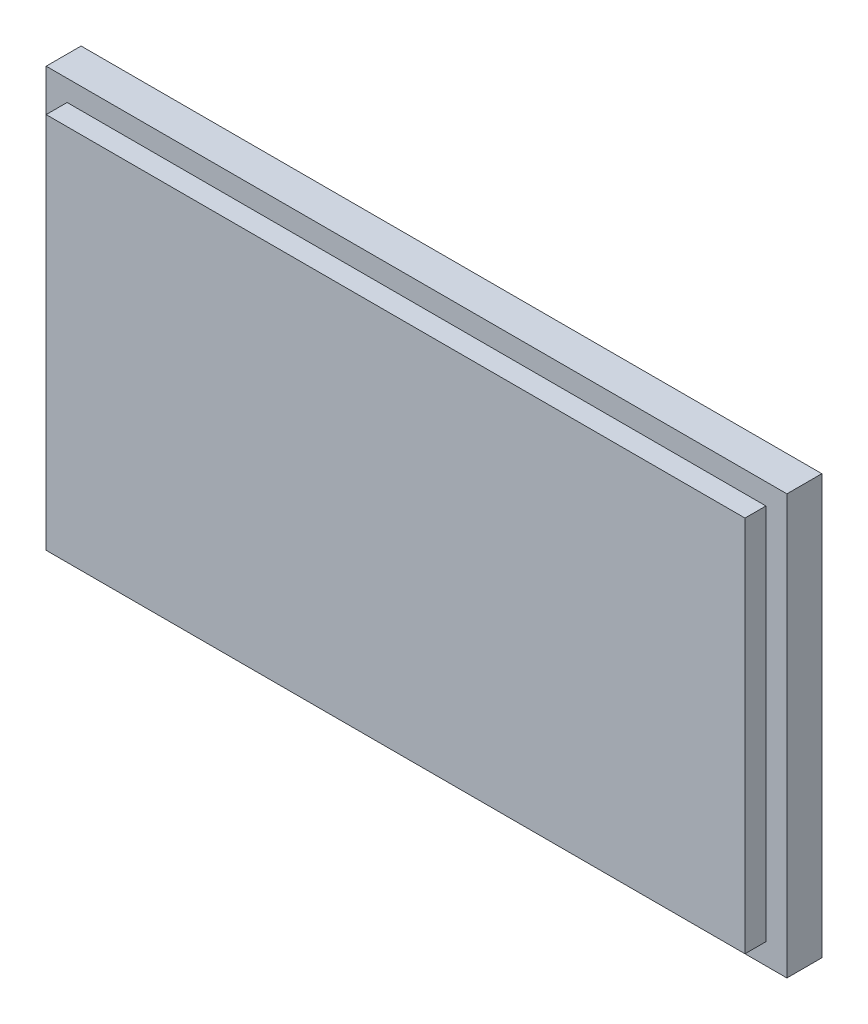
ISO-10303-21;
HEADER;
FILE_DESCRIPTION(('STEP AP214'),'2;1');
FILE_NAME('part.step','',(''),(''),'','','');
FILE_SCHEMA(('AUTOMOTIVE_DESIGN { 1 0 10303 214 1 1 1 1 }'));
ENDSEC;
DATA;
#1=APPLICATION_CONTEXT('core data for automotive mechanical design processes');
#2=APPLICATION_PROTOCOL_DEFINITION('international standard','automotive_design',2000,#1);
#3=PRODUCT_CONTEXT('',#1,'mechanical');
#4=PRODUCT('Part','Part','',(#3));
#5=PRODUCT_RELATED_PRODUCT_CATEGORY('part','',(#4));
#6=PRODUCT_DEFINITION_FORMATION('','',#4);
#7=PRODUCT_DEFINITION_CONTEXT('part definition',#1,'design');
#8=PRODUCT_DEFINITION('design','',#6,#7);
#9=PRODUCT_DEFINITION_SHAPE('','',#8);
#10=(LENGTH_UNIT() NAMED_UNIT(*) SI_UNIT(.MILLI.,.METRE.));
#11=(NAMED_UNIT(*) PLANE_ANGLE_UNIT() SI_UNIT($,.RADIAN.));
#12=(NAMED_UNIT(*) SI_UNIT($,.STERADIAN.) SOLID_ANGLE_UNIT());
#13=UNCERTAINTY_MEASURE_WITH_UNIT(LENGTH_MEASURE(1.E-05),#10,'distance_accuracy_value','');
#14=(GEOMETRIC_REPRESENTATION_CONTEXT(3) GLOBAL_UNCERTAINTY_ASSIGNED_CONTEXT((#13)) GLOBAL_UNIT_ASSIGNED_CONTEXT((#10,
#11,#12)) REPRESENTATION_CONTEXT('',''));
#15=CARTESIAN_POINT('',(0.,0.,0.));
#16=DIRECTION('',(0.,0.,1.));
#17=DIRECTION('',(1.,0.,0.));
#18=AXIS2_PLACEMENT_3D('',#15,#16,#17);
#19=CARTESIAN_POINT('',(26.5,15.,4.));
#20=DIRECTION('',(-1.,0.,0.));
#21=DIRECTION('',(0.,0.,1.));
#22=AXIS2_PLACEMENT_3D('',#19,#20,#21);
#23=PLANE('',#22);
#24=DIRECTION('',(0.,1.,0.));
#25=VECTOR('',#24,1.);
#26=CARTESIAN_POINT('',(26.5,15.,2.5));
#27=LINE('',#26,#25);
#28=CARTESIAN_POINT('',(26.5,-15.,2.5));
#29=VERTEX_POINT('',#28);
#30=CARTESIAN_POINT('',(26.5,15.,2.5));
#31=VERTEX_POINT('',#30);
#32=EDGE_CURVE('E161',#29,#31,#27,.T.);
#33=ORIENTED_EDGE('',*,*,#32,.F.);
#34=DIRECTION('',(0.,0.,-1.));
#35=VECTOR('',#34,1.);
#36=CARTESIAN_POINT('',(26.5,-15.,4.));
#37=LINE('',#36,#35);
#38=CARTESIAN_POINT('',(26.5,-15.,0.));
#39=VERTEX_POINT('',#38);
#40=EDGE_CURVE('E180',#29,#39,#37,.T.);
#41=ORIENTED_EDGE('',*,*,#40,.T.);
#42=DIRECTION('',(0.,1.,0.));
#43=VECTOR('',#42,1.);
#44=CARTESIAN_POINT('',(26.5,15.,0.));
#45=LINE('',#44,#43);
#46=CARTESIAN_POINT('',(26.5,15.,0.));
#47=VERTEX_POINT('',#46);
#48=EDGE_CURVE('E164',#39,#47,#45,.T.);
#49=ORIENTED_EDGE('',*,*,#48,.T.);
#50=DIRECTION('',(0.,0.,-1.));
#51=VECTOR('',#50,1.);
#52=CARTESIAN_POINT('',(26.5,15.,4.));
#53=LINE('',#52,#51);
#54=EDGE_CURVE('E48',#31,#47,#53,.T.);
#55=ORIENTED_EDGE('',*,*,#54,.F.);
#56=EDGE_LOOP('',(#33,#41,#49,#55));
#57=FACE_BOUND('',#56,.T.);
#58=ADVANCED_FACE('F40',(#57),#23,.F.);
#59=CARTESIAN_POINT('',(-26.5,15.,4.));
#60=DIRECTION('',(0.,-1.,0.));
#61=DIRECTION('',(0.,0.,-1.));
#62=AXIS2_PLACEMENT_3D('',#59,#60,#61);
#63=PLANE('',#62);
#64=DIRECTION('',(-1.,0.,0.));
#65=VECTOR('',#64,1.);
#66=CARTESIAN_POINT('',(-26.5,15.,2.5));
#67=LINE('',#66,#65);
#68=CARTESIAN_POINT('',(-26.5,15.,2.5));
#69=VERTEX_POINT('',#68);
#70=EDGE_CURVE('E158',#31,#69,#67,.T.);
#71=ORIENTED_EDGE('',*,*,#70,.F.);
#72=ORIENTED_EDGE('',*,*,#54,.T.);
#73=DIRECTION('',(-1.,0.,0.));
#74=VECTOR('',#73,1.);
#75=CARTESIAN_POINT('',(-26.5,15.,0.));
#76=LINE('',#75,#74);
#77=CARTESIAN_POINT('',(-26.5,15.,0.));
#78=VERTEX_POINT('',#77);
#79=EDGE_CURVE('E168',#47,#78,#76,.T.);
#80=ORIENTED_EDGE('',*,*,#79,.T.);
#81=DIRECTION('',(0.,0.,-1.));
#82=VECTOR('',#81,1.);
#83=CARTESIAN_POINT('',(-26.5,15.,4.));
#84=LINE('',#83,#82);
#85=EDGE_CURVE('E186',#69,#78,#84,.T.);
#86=ORIENTED_EDGE('',*,*,#85,.F.);
#87=EDGE_LOOP('',(#71,#72,#80,#86));
#88=FACE_BOUND('',#87,.T.);
#89=ADVANCED_FACE('F193',(#88),#63,.F.);
#90=CARTESIAN_POINT('',(-26.5,15.,4.));
#91=DIRECTION('',(1.,0.,0.));
#92=DIRECTION('',(0.,1.,0.));
#93=AXIS2_PLACEMENT_3D('',#90,#91,#92);
#94=PLANE('',#93);
#95=DIRECTION('',(0.,-1.,0.));
#96=VECTOR('',#95,1.);
#97=CARTESIAN_POINT('',(-26.5,15.,2.5));
#98=LINE('',#97,#96);
#99=CARTESIAN_POINT('',(-26.5,-15.,2.5));
#100=VERTEX_POINT('',#99);
#101=EDGE_CURVE('E54',#69,#100,#98,.T.);
#102=ORIENTED_EDGE('',*,*,#101,.F.);
#103=ORIENTED_EDGE('',*,*,#85,.T.);
#104=DIRECTION('',(0.,-1.,0.));
#105=VECTOR('',#104,1.);
#106=CARTESIAN_POINT('',(-26.5,15.,0.));
#107=LINE('',#106,#105);
#108=CARTESIAN_POINT('',(-26.5,-15.,0.));
#109=VERTEX_POINT('',#108);
#110=EDGE_CURVE('E172',#78,#109,#107,.T.);
#111=ORIENTED_EDGE('',*,*,#110,.T.);
#112=DIRECTION('',(0.,0.,-1.));
#113=VECTOR('',#112,1.);
#114=CARTESIAN_POINT('',(-26.5,-15.,4.));
#115=LINE('',#114,#113);
#116=EDGE_CURVE('E183',#100,#109,#115,.T.);
#117=ORIENTED_EDGE('',*,*,#116,.F.);
#118=EDGE_LOOP('',(#102,#103,#111,#117));
#119=FACE_BOUND('',#118,.T.);
#120=ADVANCED_FACE('F207',(#119),#94,.F.);
#121=CARTESIAN_POINT('',(-26.5,-15.,4.));
#122=DIRECTION('',(0.,1.,0.));
#123=DIRECTION('',(0.,0.,1.));
#124=AXIS2_PLACEMENT_3D('',#121,#122,#123);
#125=PLANE('',#124);
#126=DIRECTION('',(1.,0.,0.));
#127=VECTOR('',#126,1.);
#128=CARTESIAN_POINT('',(-26.5,-15.,2.5));
#129=LINE('',#128,#127);
#130=EDGE_CURVE('E12',#100,#29,#129,.T.);
#131=ORIENTED_EDGE('',*,*,#130,.F.);
#132=ORIENTED_EDGE('',*,*,#116,.T.);
#133=DIRECTION('',(1.,0.,0.));
#134=VECTOR('',#133,1.);
#135=CARTESIAN_POINT('',(-26.5,-15.,0.));
#136=LINE('',#135,#134);
#137=EDGE_CURVE('E176',#109,#39,#136,.T.);
#138=ORIENTED_EDGE('',*,*,#137,.T.);
#139=ORIENTED_EDGE('',*,*,#40,.F.);
#140=EDGE_LOOP('',(#131,#132,#138,#139));
#141=FACE_BOUND('',#140,.T.);
#142=ADVANCED_FACE('F204',(#141),#125,.F.);
#143=CARTESIAN_POINT('',(0.,0.,0.));
#144=DIRECTION('',(0.,0.,1.));
#145=DIRECTION('',(1.,0.,0.));
#146=AXIS2_PLACEMENT_3D('',#143,#144,#145);
#147=PLANE('',#146);
#148=ORIENTED_EDGE('',*,*,#48,.F.);
#149=ORIENTED_EDGE('',*,*,#137,.F.);
#150=ORIENTED_EDGE('',*,*,#110,.F.);
#151=ORIENTED_EDGE('',*,*,#79,.F.);
#152=EDGE_LOOP('',(#148,#149,#150,#151));
#153=FACE_BOUND('',#152,.T.);
#154=ADVANCED_FACE('F200',(#153),#147,.F.);
#155=CARTESIAN_POINT('',(0.,0.,2.5));
#156=DIRECTION('',(0.,0.,1.));
#157=DIRECTION('',(1.,0.,0.));
#158=AXIS2_PLACEMENT_3D('',#155,#156,#157);
#159=PLANE('',#158);
#160=DIRECTION('',(1.,0.,0.));
#161=VECTOR('',#160,1.);
#162=CARTESIAN_POINT('',(-25.,-13.5,2.5));
#163=LINE('',#162,#161);
#164=CARTESIAN_POINT('',(-25.,-13.5,2.5));
#165=VERTEX_POINT('',#164);
#166=CARTESIAN_POINT('',(25.,-13.5,2.5));
#167=VERTEX_POINT('',#166);
#168=EDGE_CURVE('E117',#165,#167,#163,.T.);
#169=ORIENTED_EDGE('',*,*,#168,.F.);
#170=DIRECTION('',(0.,-1.,0.));
#171=VECTOR('',#170,1.);
#172=CARTESIAN_POINT('',(-25.,13.5,2.5));
#173=LINE('',#172,#171);
#174=CARTESIAN_POINT('',(-25.,13.5,2.5));
#175=VERTEX_POINT('',#174);
#176=EDGE_CURVE('E126',#175,#165,#173,.T.);
#177=ORIENTED_EDGE('',*,*,#176,.F.);
#178=DIRECTION('',(-1.,0.,0.));
#179=VECTOR('',#178,1.);
#180=CARTESIAN_POINT('',(-25.,13.5,2.5));
#181=LINE('',#180,#179);
#182=CARTESIAN_POINT('',(25.,13.5,2.5));
#183=VERTEX_POINT('',#182);
#184=EDGE_CURVE('E108',#183,#175,#181,.T.);
#185=ORIENTED_EDGE('',*,*,#184,.F.);
#186=DIRECTION('',(0.,1.,0.));
#187=VECTOR('',#186,1.);
#188=CARTESIAN_POINT('',(25.,13.5,2.5));
#189=LINE('',#188,#187);
#190=EDGE_CURVE('E123',#167,#183,#189,.T.);
#191=ORIENTED_EDGE('',*,*,#190,.F.);
#192=EDGE_LOOP('',(#169,#177,#185,#191));
#193=FACE_BOUND('',#192,.T.);
#194=ORIENTED_EDGE('',*,*,#32,.T.);
#195=ORIENTED_EDGE('',*,*,#70,.T.);
#196=ORIENTED_EDGE('',*,*,#101,.T.);
#197=ORIENTED_EDGE('',*,*,#130,.T.);
#198=EDGE_LOOP('',(#194,#195,#196,#197));
#199=FACE_BOUND('',#198,.T.);
#200=ADVANCED_FACE('F122',(#193,#199),#159,.T.);
#201=CARTESIAN_POINT('',(25.,13.5,2.5));
#202=DIRECTION('',(1.,0.,0.));
#203=DIRECTION('',(0.,0.,-1.));
#204=AXIS2_PLACEMENT_3D('',#201,#202,#203);
#205=PLANE('',#204);
#206=DIRECTION('',(0.,1.,0.));
#207=VECTOR('',#206,1.);
#208=CARTESIAN_POINT('',(25.,13.5,4.));
#209=LINE('',#208,#207);
#210=CARTESIAN_POINT('',(25.,-13.5,4.));
#211=VERTEX_POINT('',#210);
#212=CARTESIAN_POINT('',(25.,13.5,4.));
#213=VERTEX_POINT('',#212);
#214=EDGE_CURVE('E142',#211,#213,#209,.T.);
#215=ORIENTED_EDGE('',*,*,#214,.F.);
#216=DIRECTION('',(0.,0.,1.));
#217=VECTOR('',#216,1.);
#218=CARTESIAN_POINT('',(25.,-13.5,2.5));
#219=LINE('',#218,#217);
#220=EDGE_CURVE('E130',#167,#211,#219,.T.);
#221=ORIENTED_EDGE('',*,*,#220,.F.);
#222=ORIENTED_EDGE('',*,*,#190,.T.);
#223=DIRECTION('',(0.,0.,1.));
#224=VECTOR('',#223,1.);
#225=CARTESIAN_POINT('',(25.,13.5,2.5));
#226=LINE('',#225,#224);
#227=EDGE_CURVE('E105',#183,#213,#226,.T.);
#228=ORIENTED_EDGE('',*,*,#227,.T.);
#229=EDGE_LOOP('',(#215,#221,#222,#228));
#230=FACE_BOUND('',#229,.T.);
#231=ADVANCED_FACE('F129',(#230),#205,.T.);
#232=CARTESIAN_POINT('',(-25.,-13.5,2.5));
#233=DIRECTION('',(0.,-1.,0.));
#234=DIRECTION('',(0.,0.,-1.));
#235=AXIS2_PLACEMENT_3D('',#232,#233,#234);
#236=PLANE('',#235);
#237=DIRECTION('',(1.,0.,0.));
#238=VECTOR('',#237,1.);
#239=CARTESIAN_POINT('',(-25.,-13.5,4.));
#240=LINE('',#239,#238);
#241=CARTESIAN_POINT('',(-25.,-13.5,4.));
#242=VERTEX_POINT('',#241);
#243=EDGE_CURVE('E132',#242,#211,#240,.T.);
#244=ORIENTED_EDGE('',*,*,#243,.F.);
#245=DIRECTION('',(0.,0.,1.));
#246=VECTOR('',#245,1.);
#247=CARTESIAN_POINT('',(-25.,-13.5,2.5));
#248=LINE('',#247,#246);
#249=EDGE_CURVE('E151',#165,#242,#248,.T.);
#250=ORIENTED_EDGE('',*,*,#249,.F.);
#251=ORIENTED_EDGE('',*,*,#168,.T.);
#252=ORIENTED_EDGE('',*,*,#220,.T.);
#253=EDGE_LOOP('',(#244,#250,#251,#252));
#254=FACE_BOUND('',#253,.T.);
#255=ADVANCED_FACE('F252',(#254),#236,.T.);
#256=CARTESIAN_POINT('',(-25.,13.5,2.5));
#257=DIRECTION('',(-1.,0.,0.));
#258=DIRECTION('',(0.,0.,1.));
#259=AXIS2_PLACEMENT_3D('',#256,#257,#258);
#260=PLANE('',#259);
#261=DIRECTION('',(0.,-1.,0.));
#262=VECTOR('',#261,1.);
#263=CARTESIAN_POINT('',(-25.,13.5,4.));
#264=LINE('',#263,#262);
#265=CARTESIAN_POINT('',(-25.,13.5,4.));
#266=VERTEX_POINT('',#265);
#267=EDGE_CURVE('E62',#266,#242,#264,.T.);
#268=ORIENTED_EDGE('',*,*,#267,.F.);
#269=DIRECTION('',(0.,0.,1.));
#270=VECTOR('',#269,1.);
#271=CARTESIAN_POINT('',(-25.,13.5,2.5));
#272=LINE('',#271,#270);
#273=EDGE_CURVE('E116',#175,#266,#272,.T.);
#274=ORIENTED_EDGE('',*,*,#273,.F.);
#275=ORIENTED_EDGE('',*,*,#176,.T.);
#276=ORIENTED_EDGE('',*,*,#249,.T.);
#277=EDGE_LOOP('',(#268,#274,#275,#276));
#278=FACE_BOUND('',#277,.T.);
#279=ADVANCED_FACE('F261',(#278),#260,.T.);
#280=CARTESIAN_POINT('',(-25.,13.5,2.5));
#281=DIRECTION('',(0.,1.,0.));
#282=DIRECTION('',(0.,0.,1.));
#283=AXIS2_PLACEMENT_3D('',#280,#281,#282);
#284=PLANE('',#283);
#285=DIRECTION('',(-1.,0.,0.));
#286=VECTOR('',#285,1.);
#287=CARTESIAN_POINT('',(-25.,13.5,4.));
#288=LINE('',#287,#286);
#289=EDGE_CURVE('E110',#213,#266,#288,.T.);
#290=ORIENTED_EDGE('',*,*,#289,.F.);
#291=ORIENTED_EDGE('',*,*,#227,.F.);
#292=ORIENTED_EDGE('',*,*,#184,.T.);
#293=ORIENTED_EDGE('',*,*,#273,.T.);
#294=EDGE_LOOP('',(#290,#291,#292,#293));
#295=FACE_BOUND('',#294,.T.);
#296=ADVANCED_FACE('F107',(#295),#284,.T.);
#297=CARTESIAN_POINT('',(0.,0.,4.));
#298=DIRECTION('',(0.,0.,1.));
#299=DIRECTION('',(1.,0.,0.));
#300=AXIS2_PLACEMENT_3D('',#297,#298,#299);
#301=PLANE('',#300);
#302=ORIENTED_EDGE('',*,*,#243,.T.);
#303=ORIENTED_EDGE('',*,*,#214,.T.);
#304=ORIENTED_EDGE('',*,*,#289,.T.);
#305=ORIENTED_EDGE('',*,*,#267,.T.);
#306=EDGE_LOOP('',(#302,#303,#304,#305));
#307=FACE_BOUND('',#306,.T.);
#308=ADVANCED_FACE('F279',(#307),#301,.T.);
#309=CLOSED_SHELL('',(#58,#89,#120,#142,#154,#200,#231,#255,#279,#296,#308));
#310=MANIFOLD_SOLID_BREP('B2',#309);
#311=ADVANCED_BREP_SHAPE_REPRESENTATION('',(#18,#310),#14);
#312=SHAPE_DEFINITION_REPRESENTATION(#9,#311);
ENDSEC;
END-ISO-10303-21;
